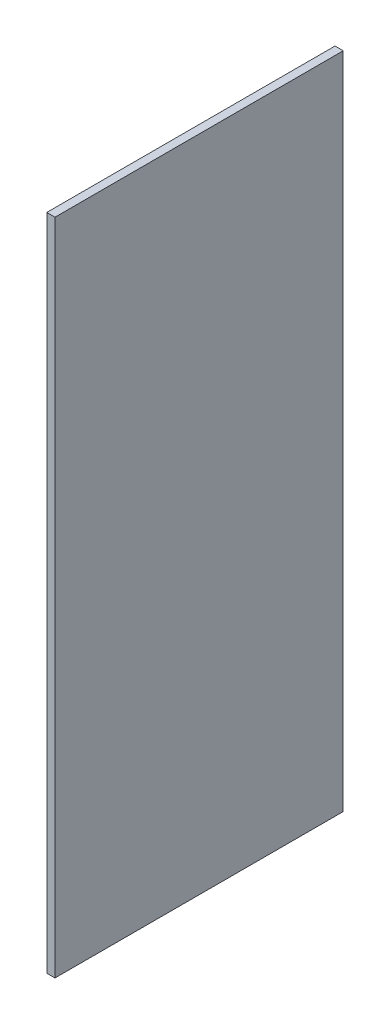
ISO-10303-21;
HEADER;
FILE_DESCRIPTION(('STEP AP214'),'2;1');
FILE_NAME('part.step','',(''),(''),'','','');
FILE_SCHEMA(('AUTOMOTIVE_DESIGN { 1 0 10303 214 1 1 1 1 }'));
ENDSEC;
DATA;
#1=APPLICATION_CONTEXT('core data for automotive mechanical design processes');
#2=APPLICATION_PROTOCOL_DEFINITION('international standard','automotive_design',2000,#1);
#3=PRODUCT_CONTEXT('',#1,'mechanical');
#4=PRODUCT('Part','Part','',(#3));
#5=PRODUCT_RELATED_PRODUCT_CATEGORY('part','',(#4));
#6=PRODUCT_DEFINITION_FORMATION('','',#4);
#7=PRODUCT_DEFINITION_CONTEXT('part definition',#1,'design');
#8=PRODUCT_DEFINITION('design','',#6,#7);
#9=PRODUCT_DEFINITION_SHAPE('','',#8);
#10=(LENGTH_UNIT() NAMED_UNIT(*) SI_UNIT(.MILLI.,.METRE.));
#11=(NAMED_UNIT(*) PLANE_ANGLE_UNIT() SI_UNIT($,.RADIAN.));
#12=(NAMED_UNIT(*) SI_UNIT($,.STERADIAN.) SOLID_ANGLE_UNIT());
#13=UNCERTAINTY_MEASURE_WITH_UNIT(LENGTH_MEASURE(1.E-05),#10,'distance_accuracy_value','');
#14=(GEOMETRIC_REPRESENTATION_CONTEXT(3) GLOBAL_UNCERTAINTY_ASSIGNED_CONTEXT((#13)) GLOBAL_UNIT_ASSIGNED_CONTEXT((#10,
#11,#12)) REPRESENTATION_CONTEXT('',''));
#15=CARTESIAN_POINT('',(0.,0.,0.));
#16=DIRECTION('',(0.,0.,1.));
#17=DIRECTION('',(1.,0.,0.));
#18=AXIS2_PLACEMENT_3D('',#15,#16,#17);
#19=CARTESIAN_POINT('',(2.54,-101.6,-44.45));
#20=DIRECTION('',(0.,0.,1.));
#21=DIRECTION('',(1.,0.,0.));
#22=AXIS2_PLACEMENT_3D('',#19,#20,#21);
#23=PLANE('',#22);
#24=DIRECTION('',(0.,1.,0.));
#25=VECTOR('',#24,1.);
#26=CARTESIAN_POINT('',(0.,-101.6,-44.45));
#27=LINE('',#26,#25);
#28=CARTESIAN_POINT('',(0.,-101.6,-44.45));
#29=VERTEX_POINT('',#28);
#30=CARTESIAN_POINT('',(0.,101.6,-44.45));
#31=VERTEX_POINT('',#30);
#32=EDGE_CURVE('E107',#29,#31,#27,.T.);
#33=ORIENTED_EDGE('',*,*,#32,.T.);
#34=DIRECTION('',(-1.,0.,0.));
#35=VECTOR('',#34,1.);
#36=CARTESIAN_POINT('',(2.54,101.6,-44.45));
#37=LINE('',#36,#35);
#38=CARTESIAN_POINT('',(2.54,101.6,-44.45));
#39=VERTEX_POINT('',#38);
#40=EDGE_CURVE('E11',#39,#31,#37,.T.);
#41=ORIENTED_EDGE('',*,*,#40,.F.);
#42=DIRECTION('',(0.,1.,0.));
#43=VECTOR('',#42,1.);
#44=CARTESIAN_POINT('',(2.54,-101.6,-44.45));
#45=LINE('',#44,#43);
#46=CARTESIAN_POINT('',(2.54,-101.6,-44.45));
#47=VERTEX_POINT('',#46);
#48=EDGE_CURVE('E91',#47,#39,#45,.T.);
#49=ORIENTED_EDGE('',*,*,#48,.F.);
#50=DIRECTION('',(-1.,0.,0.));
#51=VECTOR('',#50,1.);
#52=CARTESIAN_POINT('',(2.54,-101.6,-44.45));
#53=LINE('',#52,#51);
#54=EDGE_CURVE('E103',#47,#29,#53,.T.);
#55=ORIENTED_EDGE('',*,*,#54,.T.);
#56=EDGE_LOOP('',(#33,#41,#49,#55));
#57=FACE_BOUND('',#56,.T.);
#58=ADVANCED_FACE('F39',(#57),#23,.F.);
#59=CARTESIAN_POINT('',(2.54,101.6,44.45));
#60=DIRECTION('',(0.,-1.,0.));
#61=DIRECTION('',(0.,0.,-1.));
#62=AXIS2_PLACEMENT_3D('',#59,#60,#61);
#63=PLANE('',#62);
#64=DIRECTION('',(0.,0.,1.));
#65=VECTOR('',#64,1.);
#66=CARTESIAN_POINT('',(0.,101.6,44.45));
#67=LINE('',#66,#65);
#68=CARTESIAN_POINT('',(0.,101.6,44.45));
#69=VERTEX_POINT('',#68);
#70=EDGE_CURVE('E96',#31,#69,#67,.T.);
#71=ORIENTED_EDGE('',*,*,#70,.T.);
#72=DIRECTION('',(-1.,0.,0.));
#73=VECTOR('',#72,1.);
#74=CARTESIAN_POINT('',(2.54,101.6,44.45));
#75=LINE('',#74,#73);
#76=CARTESIAN_POINT('',(2.54,101.6,44.45));
#77=VERTEX_POINT('',#76);
#78=EDGE_CURVE('E48',#77,#69,#75,.T.);
#79=ORIENTED_EDGE('',*,*,#78,.F.);
#80=DIRECTION('',(0.,0.,1.));
#81=VECTOR('',#80,1.);
#82=CARTESIAN_POINT('',(2.54,101.6,44.45));
#83=LINE('',#82,#81);
#84=EDGE_CURVE('E86',#39,#77,#83,.T.);
#85=ORIENTED_EDGE('',*,*,#84,.F.);
#86=ORIENTED_EDGE('',*,*,#40,.T.);
#87=EDGE_LOOP('',(#71,#79,#85,#86));
#88=FACE_BOUND('',#87,.T.);
#89=ADVANCED_FACE('F95',(#88),#63,.F.);
#90=CARTESIAN_POINT('',(2.54,-101.6,44.45));
#91=DIRECTION('',(0.,0.,-1.));
#92=DIRECTION('',(-1.,0.,0.));
#93=AXIS2_PLACEMENT_3D('',#90,#91,#92);
#94=PLANE('',#93);
#95=DIRECTION('',(0.,-1.,0.));
#96=VECTOR('',#95,1.);
#97=CARTESIAN_POINT('',(0.,-101.6,44.45));
#98=LINE('',#97,#96);
#99=CARTESIAN_POINT('',(0.,-101.6,44.45));
#100=VERTEX_POINT('',#99);
#101=EDGE_CURVE('E73',#69,#100,#98,.T.);
#102=ORIENTED_EDGE('',*,*,#101,.T.);
#103=DIRECTION('',(-1.,0.,0.));
#104=VECTOR('',#103,1.);
#105=CARTESIAN_POINT('',(2.54,-101.6,44.45));
#106=LINE('',#105,#104);
#107=CARTESIAN_POINT('',(2.54,-101.6,44.45));
#108=VERTEX_POINT('',#107);
#109=EDGE_CURVE('E98',#108,#100,#106,.T.);
#110=ORIENTED_EDGE('',*,*,#109,.F.);
#111=DIRECTION('',(0.,-1.,0.));
#112=VECTOR('',#111,1.);
#113=CARTESIAN_POINT('',(2.54,-101.6,44.45));
#114=LINE('',#113,#112);
#115=EDGE_CURVE('E89',#77,#108,#114,.T.);
#116=ORIENTED_EDGE('',*,*,#115,.F.);
#117=ORIENTED_EDGE('',*,*,#78,.T.);
#118=EDGE_LOOP('',(#102,#110,#116,#117));
#119=FACE_BOUND('',#118,.T.);
#120=ADVANCED_FACE('F99',(#119),#94,.F.);
#121=CARTESIAN_POINT('',(2.54,-101.6,44.45));
#122=DIRECTION('',(0.,1.,0.));
#123=DIRECTION('',(0.,0.,1.));
#124=AXIS2_PLACEMENT_3D('',#121,#122,#123);
#125=PLANE('',#124);
#126=DIRECTION('',(0.,0.,-1.));
#127=VECTOR('',#126,1.);
#128=CARTESIAN_POINT('',(0.,-101.6,44.45));
#129=LINE('',#128,#127);
#130=EDGE_CURVE('E79',#100,#29,#129,.T.);
#131=ORIENTED_EDGE('',*,*,#130,.T.);
#132=ORIENTED_EDGE('',*,*,#54,.F.);
#133=DIRECTION('',(0.,0.,-1.));
#134=VECTOR('',#133,1.);
#135=CARTESIAN_POINT('',(2.54,-101.6,44.45));
#136=LINE('',#135,#134);
#137=EDGE_CURVE('E56',#108,#47,#136,.T.);
#138=ORIENTED_EDGE('',*,*,#137,.F.);
#139=ORIENTED_EDGE('',*,*,#109,.T.);
#140=EDGE_LOOP('',(#131,#132,#138,#139));
#141=FACE_BOUND('',#140,.T.);
#142=ADVANCED_FACE('F120',(#141),#125,.F.);
#143=CARTESIAN_POINT('',(2.54,0.,0.));
#144=DIRECTION('',(-1.,0.,0.));
#145=DIRECTION('',(0.,0.,1.));
#146=AXIS2_PLACEMENT_3D('',#143,#144,#145);
#147=PLANE('',#146);
#148=ORIENTED_EDGE('',*,*,#48,.T.);
#149=ORIENTED_EDGE('',*,*,#84,.T.);
#150=ORIENTED_EDGE('',*,*,#115,.T.);
#151=ORIENTED_EDGE('',*,*,#137,.T.);
#152=EDGE_LOOP('',(#148,#149,#150,#151));
#153=FACE_BOUND('',#152,.T.);
#154=ADVANCED_FACE('F87',(#153),#147,.F.);
#155=CARTESIAN_POINT('',(0.,0.,0.));
#156=DIRECTION('',(-1.,0.,0.));
#157=DIRECTION('',(0.,0.,1.));
#158=AXIS2_PLACEMENT_3D('',#155,#156,#157);
#159=PLANE('',#158);
#160=ORIENTED_EDGE('',*,*,#32,.F.);
#161=ORIENTED_EDGE('',*,*,#130,.F.);
#162=ORIENTED_EDGE('',*,*,#101,.F.);
#163=ORIENTED_EDGE('',*,*,#70,.F.);
#164=EDGE_LOOP('',(#160,#161,#162,#163));
#165=FACE_BOUND('',#164,.T.);
#166=ADVANCED_FACE('F123',(#165),#159,.T.);
#167=CLOSED_SHELL('',(#58,#89,#120,#142,#154,#166));
#168=MANIFOLD_SOLID_BREP('B2',#167);
#169=ADVANCED_BREP_SHAPE_REPRESENTATION('',(#18,#168),#14);
#170=SHAPE_DEFINITION_REPRESENTATION(#9,#169);
ENDSEC;
END-ISO-10303-21;
